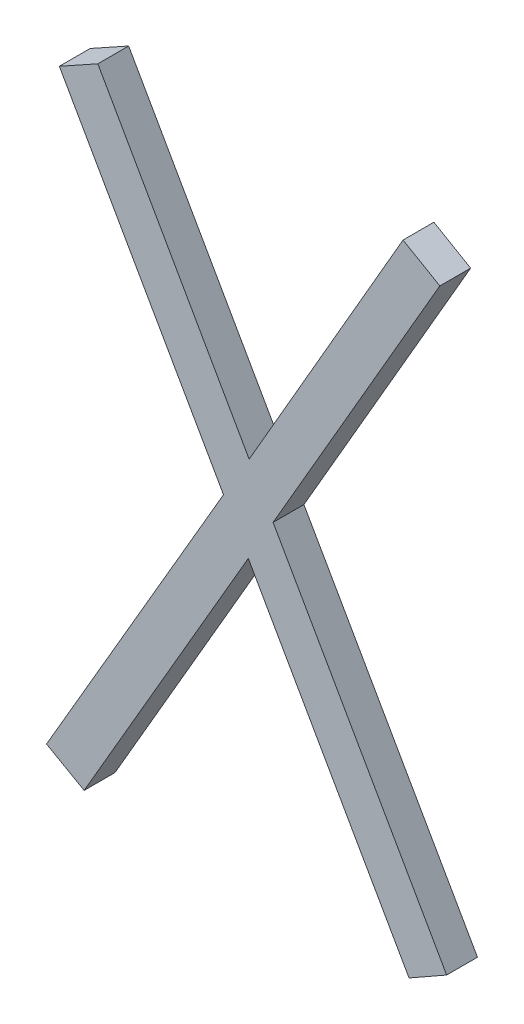
ISO-10303-21;
HEADER;
FILE_DESCRIPTION(('STEP AP214'),'2;1');
FILE_NAME('part.step','',(''),(''),'','','');
FILE_SCHEMA(('AUTOMOTIVE_DESIGN { 1 0 10303 214 1 1 1 1 }'));
ENDSEC;
DATA;
#1=APPLICATION_CONTEXT('core data for automotive mechanical design processes');
#2=APPLICATION_PROTOCOL_DEFINITION('international standard','automotive_design',2000,#1);
#3=PRODUCT_CONTEXT('',#1,'mechanical');
#4=PRODUCT('Part','Part','',(#3));
#5=PRODUCT_RELATED_PRODUCT_CATEGORY('part','',(#4));
#6=PRODUCT_DEFINITION_FORMATION('','',#4);
#7=PRODUCT_DEFINITION_CONTEXT('part definition',#1,'design');
#8=PRODUCT_DEFINITION('design','',#6,#7);
#9=PRODUCT_DEFINITION_SHAPE('','',#8);
#10=(LENGTH_UNIT() NAMED_UNIT(*) SI_UNIT(.MILLI.,.METRE.));
#11=(NAMED_UNIT(*) PLANE_ANGLE_UNIT() SI_UNIT($,.RADIAN.));
#12=(NAMED_UNIT(*) SI_UNIT($,.STERADIAN.) SOLID_ANGLE_UNIT());
#13=UNCERTAINTY_MEASURE_WITH_UNIT(LENGTH_MEASURE(1.E-05),#10,'distance_accuracy_value','');
#14=(GEOMETRIC_REPRESENTATION_CONTEXT(3) GLOBAL_UNCERTAINTY_ASSIGNED_CONTEXT((#13)) GLOBAL_UNIT_ASSIGNED_CONTEXT((#10,
#11,#12)) REPRESENTATION_CONTEXT('',''));
#15=CARTESIAN_POINT('',(0.,0.,0.));
#16=DIRECTION('',(0.,0.,1.));
#17=DIRECTION('',(1.,0.,0.));
#18=AXIS2_PLACEMENT_3D('',#15,#16,#17);
#19=CARTESIAN_POINT('',(145.139979181208,65.812635981698,-39.));
#20=DIRECTION('',(0.,0.,-1.));
#21=DIRECTION('',(-1.,0.,0.));
#22=AXIS2_PLACEMENT_3D('',#19,#20,#21);
#23=PLANE('',#22);
#24=DIRECTION('',(-0.501757199087615,-0.865008504677122,0.));
#25=VECTOR('',#24,1.);
#26=CARTESIAN_POINT('',(145.257451896209,65.7458901209018,-39.));
#27=LINE('',#26,#25);
#28=CARTESIAN_POINT('',(145.25745189621,65.7458901209013,-39.));
#29=VERTEX_POINT('',#28);
#30=CARTESIAN_POINT('',(145.790045516181,66.6640593303316,-39.));
#31=VERTEX_POINT('',#30);
#32=EDGE_CURVE('E161',#29,#31,#27,.F.);
#33=ORIENTED_EDGE('',*,*,#32,.T.);
#34=DIRECTION('',(-0.493874000371215,0.86953347937692,0.));
#35=VECTOR('',#34,1.);
#36=CARTESIAN_POINT('',(145.790045516184,66.6640593303331,-39.));
#37=LINE('',#36,#35);
#38=CARTESIAN_POINT('',(146.31154343574,65.7458901209017,-39.));
#39=VERTEX_POINT('',#38);
#40=EDGE_CURVE('E156',#31,#39,#37,.F.);
#41=ORIENTED_EDGE('',*,*,#40,.T.);
#42=DIRECTION('',(-0.86945655739279,-0.494009407609488,0.));
#43=VECTOR('',#42,1.);
#44=CARTESIAN_POINT('',(146.311543435739,65.7458901209037,-39.));
#45=LINE('',#44,#43);
#46=CARTESIAN_POINT('',(146.433596140312,65.8152382485021,-39.));
#47=VERTEX_POINT('',#46);
#48=EDGE_CURVE('E152',#39,#47,#45,.F.);
#49=ORIENTED_EDGE('',*,*,#48,.T.);
#50=DIRECTION('',(0.494302224488393,-0.869290118927983,0.));
#51=VECTOR('',#50,1.);
#52=CARTESIAN_POINT('',(146.433596140317,65.8152382485049,-39.));
#53=LINE('',#52,#51);
#54=CARTESIAN_POINT('',(145.8704893442,66.8055295106412,-39.));
#55=VERTEX_POINT('',#54);
#56=EDGE_CURVE('E148',#47,#55,#53,.F.);
#57=ORIENTED_EDGE('',*,*,#56,.T.);
#58=DIRECTION('',(-0.500833770570702,-0.865543490678506,0.));
#59=VECTOR('',#58,1.);
#60=CARTESIAN_POINT('',(145.870489344199,66.8055295106417,-39.));
#61=LINE('',#60,#59);
#62=CARTESIAN_POINT('',(146.41140473948,67.7403422706913,-39.));
#63=VERTEX_POINT('',#62);
#64=EDGE_CURVE('E144',#55,#63,#61,.F.);
#65=ORIENTED_EDGE('',*,*,#64,.T.);
#66=DIRECTION('',(0.864507186684154,-0.502620457374597,0.));
#67=VECTOR('',#66,1.);
#68=CARTESIAN_POINT('',(146.411404739481,67.740342270692,-39.));
#69=LINE('',#68,#67);
#70=CARTESIAN_POINT('',(146.292125960011,67.809690398291,-39.));
#71=VERTEX_POINT('',#70);
#72=EDGE_CURVE('E140',#63,#71,#69,.F.);
#73=ORIENTED_EDGE('',*,*,#72,.T.);
#74=DIRECTION('',(0.499722453489601,0.866185586048587,0.));
#75=VECTOR('',#74,1.);
#76=CARTESIAN_POINT('',(146.292125960011,67.8096903982906,-39.));
#77=LINE('',#76,#75);
#78=CARTESIAN_POINT('',(145.792819441288,66.9442257658399,-39.));
#79=VERTEX_POINT('',#78);
#80=EDGE_CURVE('E136',#71,#79,#77,.F.);
#81=ORIENTED_EDGE('',*,*,#80,.T.);
#82=DIRECTION('',(0.493434547487701,-0.869782931164787,0.));
#83=VECTOR('',#82,1.);
#84=CARTESIAN_POINT('',(145.792819441282,66.9442257658365,-39.));
#85=LINE('',#84,#83);
#86=CARTESIAN_POINT('',(145.30183469787,67.8096903982911,-39.));
#87=VERTEX_POINT('',#86);
#88=EDGE_CURVE('E132',#79,#87,#85,.F.);
#89=ORIENTED_EDGE('',*,*,#88,.T.);
#90=DIRECTION('',(0.874157276121506,0.485642931178689,0.));
#91=VECTOR('',#90,1.);
#92=CARTESIAN_POINT('',(145.30183469787,67.8096903982911,-39.));
#93=LINE('',#92,#91);
#94=CARTESIAN_POINT('',(145.17700806819,67.7403422706908,-39.));
#95=VERTEX_POINT('',#94);
#96=EDGE_CURVE('E128',#87,#95,#93,.F.);
#97=ORIENTED_EDGE('',*,*,#96,.T.);
#98=DIRECTION('',(-0.493921009717573,0.869506777523656,0.));
#99=VECTOR('',#98,1.);
#100=CARTESIAN_POINT('',(145.177008068188,67.74034227069,-39.));
#101=LINE('',#100,#99);
#102=CARTESIAN_POINT('',(145.709601688161,66.8027555855309,-39.));
#103=VERTEX_POINT('',#102);
#104=EDGE_CURVE('E104',#95,#103,#101,.F.);
#105=ORIENTED_EDGE('',*,*,#104,.T.);
#106=DIRECTION('',(0.50266266285792,0.864482647233931,0.));
#107=VECTOR('',#106,1.);
#108=CARTESIAN_POINT('',(145.709601688161,66.8027555855305,-39.));
#109=LINE('',#108,#107);
#110=CARTESIAN_POINT('',(145.135399191631,65.8152382485028,-39.));
#111=VERTEX_POINT('',#110);
#112=EDGE_CURVE('E106',#103,#111,#109,.F.);
#113=ORIENTED_EDGE('',*,*,#112,.T.);
#114=DIRECTION('',(-0.869456557392796,0.494009407609479,0.));
#115=VECTOR('',#114,1.);
#116=CARTESIAN_POINT('',(145.135399191631,65.8152382485028,-39.));
#117=LINE('',#116,#115);
#118=EDGE_CURVE('E20',#111,#29,#117,.F.);
#119=ORIENTED_EDGE('',*,*,#118,.T.);
#120=EDGE_LOOP('',(#33,#41,#49,#57,#65,#73,#81,#89,#97,#105,#113,#119));
#121=FACE_BOUND('',#120,.T.);
#122=ADVANCED_FACE('F17',(#121),#23,.F.);
#123=CARTESIAN_POINT('',(145.135399191631,65.8152382485028,-39.));
#124=DIRECTION('',(0.494009407609479,0.869456557392796,0.));
#125=DIRECTION('',(-0.869456557392796,0.494009407609479,0.));
#126=AXIS2_PLACEMENT_3D('',#123,#124,#125);
#127=PLANE('',#126);
#128=DIRECTION('',(0.,0.,1.));
#129=VECTOR('',#128,1.);
#130=CARTESIAN_POINT('',(145.257451896209,65.7458901209018,-39.));
#131=LINE('',#130,#129);
#132=CARTESIAN_POINT('',(145.25745189621,65.7458901209013,-39.1));
#133=VERTEX_POINT('',#132);
#134=EDGE_CURVE('E117',#133,#29,#131,.T.);
#135=ORIENTED_EDGE('',*,*,#134,.T.);
#136=ORIENTED_EDGE('',*,*,#118,.F.);
#137=DIRECTION('',(0.,0.,1.));
#138=VECTOR('',#137,1.);
#139=CARTESIAN_POINT('',(145.135399191631,65.8152382485028,-39.));
#140=LINE('',#139,#138);
#141=CARTESIAN_POINT('',(145.135399191631,65.8152382485028,-39.1));
#142=VERTEX_POINT('',#141);
#143=EDGE_CURVE('E112',#111,#142,#140,.F.);
#144=ORIENTED_EDGE('',*,*,#143,.T.);
#145=DIRECTION('',(-0.869456557392753,0.494009407609555,0.));
#146=VECTOR('',#145,1.);
#147=CARTESIAN_POINT('',(145.25745189621,65.7458901209011,-39.1));
#148=LINE('',#147,#146);
#149=EDGE_CURVE('E164',#133,#142,#148,.T.);
#150=ORIENTED_EDGE('',*,*,#149,.F.);
#151=EDGE_LOOP('',(#135,#136,#144,#150));
#152=FACE_BOUND('',#151,.T.);
#153=ADVANCED_FACE('F114',(#152),#127,.F.);
#154=CARTESIAN_POINT('',(145.709601688161,66.8027555855305,-39.));
#155=DIRECTION('',(0.864482647233931,-0.50266266285792,0.));
#156=DIRECTION('',(0.50266266285792,0.864482647233931,0.));
#157=AXIS2_PLACEMENT_3D('',#154,#155,#156);
#158=PLANE('',#157);
#159=ORIENTED_EDGE('',*,*,#143,.F.);
#160=ORIENTED_EDGE('',*,*,#112,.F.);
#161=DIRECTION('',(0.,0.,1.));
#162=VECTOR('',#161,1.);
#163=CARTESIAN_POINT('',(145.70960168816,66.8027555855311,-39.));
#164=LINE('',#163,#162);
#165=CARTESIAN_POINT('',(145.709601688161,66.8027555855308,-39.1));
#166=VERTEX_POINT('',#165);
#167=EDGE_CURVE('E124',#103,#166,#164,.F.);
#168=ORIENTED_EDGE('',*,*,#167,.T.);
#169=DIRECTION('',(0.502662662856952,0.864482647234494,0.));
#170=VECTOR('',#169,1.);
#171=CARTESIAN_POINT('',(145.135399191631,65.8152382485028,-39.1));
#172=LINE('',#171,#170);
#173=EDGE_CURVE('E121',#142,#166,#172,.T.);
#174=ORIENTED_EDGE('',*,*,#173,.F.);
#175=EDGE_LOOP('',(#159,#160,#168,#174));
#176=FACE_BOUND('',#175,.T.);
#177=ADVANCED_FACE('F119',(#176),#158,.F.);
#178=CARTESIAN_POINT('',(145.177008068188,67.74034227069,-39.));
#179=DIRECTION('',(0.869506777523656,0.493921009717573,0.));
#180=DIRECTION('',(-0.493921009717573,0.869506777523656,0.));
#181=AXIS2_PLACEMENT_3D('',#178,#179,#180);
#182=PLANE('',#181);
#183=ORIENTED_EDGE('',*,*,#167,.F.);
#184=ORIENTED_EDGE('',*,*,#104,.F.);
#185=DIRECTION('',(0.,0.,1.));
#186=VECTOR('',#185,1.);
#187=CARTESIAN_POINT('',(145.17700806819,67.7403422706911,-39.));
#188=LINE('',#187,#186);
#189=CARTESIAN_POINT('',(145.177008068189,67.7403422706905,-39.1));
#190=VERTEX_POINT('',#189);
#191=EDGE_CURVE('E130',#95,#190,#188,.F.);
#192=ORIENTED_EDGE('',*,*,#191,.T.);
#193=DIRECTION('',(-0.493921009715806,0.86950677752466,0.));
#194=VECTOR('',#193,1.);
#195=CARTESIAN_POINT('',(145.70960168816,66.8027555855311,-39.1));
#196=LINE('',#195,#194);
#197=EDGE_CURVE('E167',#166,#190,#196,.T.);
#198=ORIENTED_EDGE('',*,*,#197,.F.);
#199=EDGE_LOOP('',(#183,#184,#192,#198));
#200=FACE_BOUND('',#199,.T.);
#201=ADVANCED_FACE('F232',(#200),#182,.F.);
#202=CARTESIAN_POINT('',(145.30183469787,67.8096903982911,-39.));
#203=DIRECTION('',(0.485642931178689,-0.874157276121506,0.));
#204=DIRECTION('',(0.874157276121506,0.485642931178689,0.));
#205=AXIS2_PLACEMENT_3D('',#202,#203,#204);
#206=PLANE('',#205);
#207=ORIENTED_EDGE('',*,*,#191,.F.);
#208=ORIENTED_EDGE('',*,*,#96,.F.);
#209=DIRECTION('',(0.,0.,1.));
#210=VECTOR('',#209,1.);
#211=CARTESIAN_POINT('',(145.30183469787,67.8096903982911,-39.));
#212=LINE('',#211,#210);
#213=CARTESIAN_POINT('',(145.30183469787,67.8096903982911,-39.1));
#214=VERTEX_POINT('',#213);
#215=EDGE_CURVE('E134',#87,#214,#212,.F.);
#216=ORIENTED_EDGE('',*,*,#215,.T.);
#217=DIRECTION('',(0.874157276121542,0.485642931178624,0.));
#218=VECTOR('',#217,1.);
#219=CARTESIAN_POINT('',(145.17700806819,67.7403422706911,-39.1));
#220=LINE('',#219,#218);
#221=EDGE_CURVE('E170',#190,#214,#220,.T.);
#222=ORIENTED_EDGE('',*,*,#221,.F.);
#223=EDGE_LOOP('',(#207,#208,#216,#222));
#224=FACE_BOUND('',#223,.T.);
#225=ADVANCED_FACE('F230',(#224),#206,.F.);
#226=CARTESIAN_POINT('',(145.792819441282,66.9442257658365,-39.));
#227=DIRECTION('',(-0.869782931164787,-0.493434547487701,0.));
#228=DIRECTION('',(0.493434547487701,-0.869782931164787,0.));
#229=AXIS2_PLACEMENT_3D('',#226,#227,#228);
#230=PLANE('',#229);
#231=ORIENTED_EDGE('',*,*,#215,.F.);
#232=ORIENTED_EDGE('',*,*,#88,.F.);
#233=DIRECTION('',(0.,0.,1.));
#234=VECTOR('',#233,1.);
#235=CARTESIAN_POINT('',(145.79281944129,66.9442257658411,-39.));
#236=LINE('',#235,#234);
#237=CARTESIAN_POINT('',(145.792819441286,66.9442257658388,-39.1));
#238=VERTEX_POINT('',#237);
#239=EDGE_CURVE('E138',#79,#238,#236,.F.);
#240=ORIENTED_EDGE('',*,*,#239,.T.);
#241=DIRECTION('',(0.493434547495964,-0.869782931160099,0.));
#242=VECTOR('',#241,1.);
#243=CARTESIAN_POINT('',(145.30183469787,67.8096903982911,-39.1));
#244=LINE('',#243,#242);
#245=EDGE_CURVE('E173',#214,#238,#244,.T.);
#246=ORIENTED_EDGE('',*,*,#245,.F.);
#247=EDGE_LOOP('',(#231,#232,#240,#246));
#248=FACE_BOUND('',#247,.T.);
#249=ADVANCED_FACE('F225',(#248),#230,.F.);
#250=CARTESIAN_POINT('',(146.292125960011,67.8096903982906,-39.));
#251=DIRECTION('',(0.866185586048587,-0.499722453489601,0.));
#252=DIRECTION('',(0.499722453489601,0.866185586048587,0.));
#253=AXIS2_PLACEMENT_3D('',#250,#251,#252);
#254=PLANE('',#253);
#255=ORIENTED_EDGE('',*,*,#239,.F.);
#256=ORIENTED_EDGE('',*,*,#80,.F.);
#257=DIRECTION('',(0.,0.,1.));
#258=VECTOR('',#257,1.);
#259=CARTESIAN_POINT('',(146.29212596001,67.8096903982911,-39.));
#260=LINE('',#259,#258);
#261=CARTESIAN_POINT('',(146.292125960011,67.8096903982909,-39.1));
#262=VERTEX_POINT('',#261);
#263=EDGE_CURVE('E142',#71,#262,#260,.F.);
#264=ORIENTED_EDGE('',*,*,#263,.T.);
#265=DIRECTION('',(0.499722453488721,0.866185586049094,0.));
#266=VECTOR('',#265,1.);
#267=CARTESIAN_POINT('',(145.79281944129,66.9442257658411,-39.1));
#268=LINE('',#267,#266);
#269=EDGE_CURVE('E176',#238,#262,#268,.T.);
#270=ORIENTED_EDGE('',*,*,#269,.F.);
#271=EDGE_LOOP('',(#255,#256,#264,#270));
#272=FACE_BOUND('',#271,.T.);
#273=ADVANCED_FACE('F220',(#272),#254,.F.);
#274=CARTESIAN_POINT('',(146.411404739481,67.740342270692,-39.));
#275=DIRECTION('',(-0.502620457374597,-0.864507186684154,0.));
#276=DIRECTION('',(0.864507186684154,-0.502620457374597,0.));
#277=AXIS2_PLACEMENT_3D('',#274,#275,#276);
#278=PLANE('',#277);
#279=ORIENTED_EDGE('',*,*,#263,.F.);
#280=ORIENTED_EDGE('',*,*,#72,.F.);
#281=DIRECTION('',(0.,0.,1.));
#282=VECTOR('',#281,1.);
#283=CARTESIAN_POINT('',(146.41140473948,67.7403422706911,-39.));
#284=LINE('',#283,#282);
#285=CARTESIAN_POINT('',(146.411404739481,67.7403422706916,-39.1));
#286=VERTEX_POINT('',#285);
#287=EDGE_CURVE('E146',#63,#286,#284,.F.);
#288=ORIENTED_EDGE('',*,*,#287,.T.);
#289=DIRECTION('',(0.86450718668052,-0.502620457380847,0.));
#290=VECTOR('',#289,1.);
#291=CARTESIAN_POINT('',(146.29212596001,67.8096903982911,-39.1));
#292=LINE('',#291,#290);
#293=EDGE_CURVE('E179',#262,#286,#292,.T.);
#294=ORIENTED_EDGE('',*,*,#293,.F.);
#295=EDGE_LOOP('',(#279,#280,#288,#294));
#296=FACE_BOUND('',#295,.T.);
#297=ADVANCED_FACE('F215',(#296),#278,.F.);
#298=CARTESIAN_POINT('',(145.870489344199,66.8055295106417,-39.));
#299=DIRECTION('',(-0.865543490678506,0.500833770570702,0.));
#300=DIRECTION('',(-0.500833770570702,-0.865543490678506,0.));
#301=AXIS2_PLACEMENT_3D('',#298,#299,#300);
#302=PLANE('',#301);
#303=ORIENTED_EDGE('',*,*,#287,.F.);
#304=ORIENTED_EDGE('',*,*,#64,.F.);
#305=DIRECTION('',(0.,0.,1.));
#306=VECTOR('',#305,1.);
#307=CARTESIAN_POINT('',(145.8704893442,66.8055295106411,-39.));
#308=LINE('',#307,#306);
#309=CARTESIAN_POINT('',(145.8704893442,66.8055295106414,-39.1));
#310=VERTEX_POINT('',#309);
#311=EDGE_CURVE('E150',#55,#310,#308,.F.);
#312=ORIENTED_EDGE('',*,*,#311,.T.);
#313=DIRECTION('',(-0.500833770569863,-0.865543490678992,0.));
#314=VECTOR('',#313,1.);
#315=CARTESIAN_POINT('',(146.41140473948,67.7403422706911,-39.1));
#316=LINE('',#315,#314);
#317=EDGE_CURVE('E182',#286,#310,#316,.T.);
#318=ORIENTED_EDGE('',*,*,#317,.F.);
#319=EDGE_LOOP('',(#303,#304,#312,#318));
#320=FACE_BOUND('',#319,.T.);
#321=ADVANCED_FACE('F210',(#320),#302,.F.);
#322=CARTESIAN_POINT('',(146.433596140317,65.8152382485049,-39.));
#323=DIRECTION('',(-0.869290118927983,-0.494302224488393,0.));
#324=DIRECTION('',(0.494302224488393,-0.869290118927983,0.));
#325=AXIS2_PLACEMENT_3D('',#322,#323,#324);
#326=PLANE('',#325);
#327=ORIENTED_EDGE('',*,*,#311,.F.);
#328=ORIENTED_EDGE('',*,*,#56,.F.);
#329=DIRECTION('',(0.,0.,1.));
#330=VECTOR('',#329,1.);
#331=CARTESIAN_POINT('',(146.43359614031,65.8152382485011,-39.));
#332=LINE('',#331,#330);
#333=CARTESIAN_POINT('',(146.433596140314,65.815238248503,-39.1));
#334=VERTEX_POINT('',#333);
#335=EDGE_CURVE('E154',#47,#334,#332,.F.);
#336=ORIENTED_EDGE('',*,*,#335,.T.);
#337=DIRECTION('',(0.494302224482588,-0.869290118931284,0.));
#338=VECTOR('',#337,1.);
#339=CARTESIAN_POINT('',(145.8704893442,66.8055295106411,-39.1));
#340=LINE('',#339,#338);
#341=EDGE_CURVE('E185',#310,#334,#340,.T.);
#342=ORIENTED_EDGE('',*,*,#341,.F.);
#343=EDGE_LOOP('',(#327,#328,#336,#342));
#344=FACE_BOUND('',#343,.T.);
#345=ADVANCED_FACE('F205',(#344),#326,.F.);
#346=CARTESIAN_POINT('',(146.311543435739,65.7458901209037,-39.));
#347=DIRECTION('',(-0.494009407609488,0.86945655739279,0.));
#348=DIRECTION('',(-0.86945655739279,-0.494009407609488,0.));
#349=AXIS2_PLACEMENT_3D('',#346,#347,#348);
#350=PLANE('',#349);
#351=ORIENTED_EDGE('',*,*,#335,.F.);
#352=ORIENTED_EDGE('',*,*,#48,.F.);
#353=DIRECTION('',(0.,0.,1.));
#354=VECTOR('',#353,1.);
#355=CARTESIAN_POINT('',(146.31154343574,65.7458901209011,-39.));
#356=LINE('',#355,#354);
#357=CARTESIAN_POINT('',(146.31154343574,65.7458901209024,-39.1));
#358=VERTEX_POINT('',#357);
#359=EDGE_CURVE('E158',#39,#358,#356,.F.);
#360=ORIENTED_EDGE('',*,*,#359,.T.);
#361=DIRECTION('',(-0.869456557382251,-0.494009407628037,0.));
#362=VECTOR('',#361,1.);
#363=CARTESIAN_POINT('',(146.43359614031,65.8152382485011,-39.1));
#364=LINE('',#363,#362);
#365=EDGE_CURVE('E188',#334,#358,#364,.T.);
#366=ORIENTED_EDGE('',*,*,#365,.F.);
#367=EDGE_LOOP('',(#351,#352,#360,#366));
#368=FACE_BOUND('',#367,.T.);
#369=ADVANCED_FACE('F200',(#368),#350,.F.);
#370=CARTESIAN_POINT('',(145.790045516184,66.6640593303331,-39.));
#371=DIRECTION('',(0.86953347937692,0.493874000371215,0.));
#372=DIRECTION('',(-0.493874000371215,0.86953347937692,0.));
#373=AXIS2_PLACEMENT_3D('',#370,#371,#372);
#374=PLANE('',#373);
#375=ORIENTED_EDGE('',*,*,#359,.F.);
#376=ORIENTED_EDGE('',*,*,#40,.F.);
#377=DIRECTION('',(0.,0.,1.));
#378=VECTOR('',#377,1.);
#379=CARTESIAN_POINT('',(145.79004551618,66.6640593303311,-39.));
#380=LINE('',#379,#378);
#381=CARTESIAN_POINT('',(145.790045516182,66.6640593303321,-39.1));
#382=VERTEX_POINT('',#381);
#383=EDGE_CURVE('E35',#31,#382,#380,.F.);
#384=ORIENTED_EDGE('',*,*,#383,.T.);
#385=DIRECTION('',(-0.493874000374488,0.869533479375061,0.));
#386=VECTOR('',#385,1.);
#387=CARTESIAN_POINT('',(146.31154343574,65.7458901209011,-39.1));
#388=LINE('',#387,#386);
#389=EDGE_CURVE('E26',#358,#382,#388,.T.);
#390=ORIENTED_EDGE('',*,*,#389,.F.);
#391=EDGE_LOOP('',(#375,#376,#384,#390));
#392=FACE_BOUND('',#391,.T.);
#393=ADVANCED_FACE('F196',(#392),#374,.F.);
#394=CARTESIAN_POINT('',(145.257451896209,65.7458901209018,-39.));
#395=DIRECTION('',(-0.865008504677122,0.501757199087615,0.));
#396=DIRECTION('',(-0.501757199087615,-0.865008504677122,0.));
#397=AXIS2_PLACEMENT_3D('',#394,#395,#396);
#398=PLANE('',#397);
#399=ORIENTED_EDGE('',*,*,#383,.F.);
#400=ORIENTED_EDGE('',*,*,#32,.F.);
#401=ORIENTED_EDGE('',*,*,#134,.F.);
#402=DIRECTION('',(-0.501757199086575,-0.865008504677726,0.));
#403=VECTOR('',#402,1.);
#404=CARTESIAN_POINT('',(145.79004551618,66.6640593303311,-39.1));
#405=LINE('',#404,#403);
#406=EDGE_CURVE('E11',#382,#133,#405,.T.);
#407=ORIENTED_EDGE('',*,*,#406,.F.);
#408=EDGE_LOOP('',(#399,#400,#401,#407));
#409=FACE_BOUND('',#408,.T.);
#410=ADVANCED_FACE('F235',(#409),#398,.F.);
#411=CARTESIAN_POINT('',(145.139979181208,65.812635981698,-39.1));
#412=DIRECTION('',(0.,0.,-1.));
#413=DIRECTION('',(-1.,0.,0.));
#414=AXIS2_PLACEMENT_3D('',#411,#412,#413);
#415=PLANE('',#414);
#416=ORIENTED_EDGE('',*,*,#389,.T.);
#417=ORIENTED_EDGE('',*,*,#406,.T.);
#418=ORIENTED_EDGE('',*,*,#149,.T.);
#419=ORIENTED_EDGE('',*,*,#173,.T.);
#420=ORIENTED_EDGE('',*,*,#197,.T.);
#421=ORIENTED_EDGE('',*,*,#221,.T.);
#422=ORIENTED_EDGE('',*,*,#245,.T.);
#423=ORIENTED_EDGE('',*,*,#269,.T.);
#424=ORIENTED_EDGE('',*,*,#293,.T.);
#425=ORIENTED_EDGE('',*,*,#317,.T.);
#426=ORIENTED_EDGE('',*,*,#341,.T.);
#427=ORIENTED_EDGE('',*,*,#365,.T.);
#428=EDGE_LOOP('',(#416,#417,#418,#419,#420,#421,#422,#423,#424,#425,#426,#427));
#429=FACE_BOUND('',#428,.T.);
#430=ADVANCED_FACE('F193',(#429),#415,.T.);
#431=CLOSED_SHELL('',(#122,#153,#177,#201,#225,#249,#273,#297,#321,#345,#369,#393,#410,#430));
#432=MANIFOLD_SOLID_BREP('B1',#431);
#433=ADVANCED_BREP_SHAPE_REPRESENTATION('',(#18,#432),#14);
#434=SHAPE_DEFINITION_REPRESENTATION(#9,#433);
ENDSEC;
END-ISO-10303-21;
